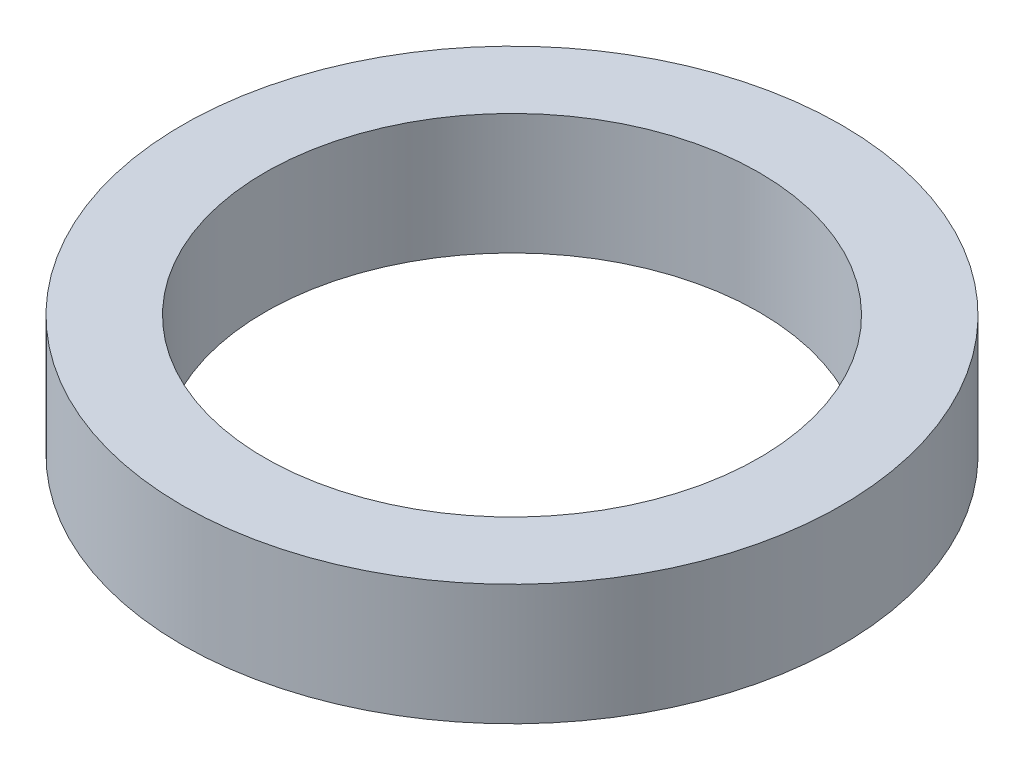
ISO-10303-21;
HEADER;
FILE_DESCRIPTION(('STEP AP214'),'2;1');
FILE_NAME('part.step','',(''),(''),'','','');
FILE_SCHEMA(('AUTOMOTIVE_DESIGN { 1 0 10303 214 1 1 1 1 }'));
ENDSEC;
DATA;
#1=APPLICATION_CONTEXT('core data for automotive mechanical design processes');
#2=APPLICATION_PROTOCOL_DEFINITION('international standard','automotive_design',2000,#1);
#3=PRODUCT_CONTEXT('',#1,'mechanical');
#4=PRODUCT('Part','Part','',(#3));
#5=PRODUCT_RELATED_PRODUCT_CATEGORY('part','',(#4));
#6=PRODUCT_DEFINITION_FORMATION('','',#4);
#7=PRODUCT_DEFINITION_CONTEXT('part definition',#1,'design');
#8=PRODUCT_DEFINITION('design','',#6,#7);
#9=PRODUCT_DEFINITION_SHAPE('','',#8);
#10=(LENGTH_UNIT() NAMED_UNIT(*) SI_UNIT(.MILLI.,.METRE.));
#11=(NAMED_UNIT(*) PLANE_ANGLE_UNIT() SI_UNIT($,.RADIAN.));
#12=(NAMED_UNIT(*) SI_UNIT($,.STERADIAN.) SOLID_ANGLE_UNIT());
#13=UNCERTAINTY_MEASURE_WITH_UNIT(LENGTH_MEASURE(1.E-05),#10,'distance_accuracy_value','');
#14=(GEOMETRIC_REPRESENTATION_CONTEXT(3) GLOBAL_UNCERTAINTY_ASSIGNED_CONTEXT((#13)) GLOBAL_UNIT_ASSIGNED_CONTEXT((#10,
#11,#12)) REPRESENTATION_CONTEXT('',''));
#15=CARTESIAN_POINT('',(0.,0.,0.));
#16=DIRECTION('',(0.,0.,1.));
#17=DIRECTION('',(1.,0.,0.));
#18=AXIS2_PLACEMENT_3D('',#15,#16,#17);
#19=CARTESIAN_POINT('',(0.,0.,0.));
#20=DIRECTION('',(0.,1.,0.));
#21=DIRECTION('',(0.,0.,1.));
#22=AXIS2_PLACEMENT_3D('',#19,#20,#21);
#23=PLANE('',#22);
#24=CARTESIAN_POINT('',(0.,0.,0.));
#25=DIRECTION('',(0.,-1.,0.));
#26=DIRECTION('',(0.,0.,-1.));
#27=AXIS2_PLACEMENT_3D('',#24,#25,#26);
#28=CIRCLE('',#27,45.);
#29=CARTESIAN_POINT('',(0.,0.,-45.));
#30=VERTEX_POINT('',#29);
#31=EDGE_CURVE('E26',#30,#30,#28,.F.);
#32=ORIENTED_EDGE('',*,*,#31,.T.);
#33=EDGE_LOOP('',(#32));
#34=FACE_BOUND('',#33,.T.);
#35=CARTESIAN_POINT('',(0.,0.,0.));
#36=DIRECTION('',(0.,-1.,0.));
#37=DIRECTION('',(0.,0.,-1.));
#38=AXIS2_PLACEMENT_3D('',#35,#36,#37);
#39=CIRCLE('',#38,60.);
#40=CARTESIAN_POINT('',(0.,0.,-60.));
#41=VERTEX_POINT('',#40);
#42=EDGE_CURVE('E17',#41,#41,#39,.F.);
#43=ORIENTED_EDGE('',*,*,#42,.F.);
#44=EDGE_LOOP('',(#43));
#45=FACE_BOUND('',#44,.T.);
#46=ADVANCED_FACE('F14',(#34,#45),#23,.F.);
#47=CARTESIAN_POINT('',(0.,22.,0.));
#48=DIRECTION('',(0.,-1.,0.));
#49=DIRECTION('',(0.,0.,-1.));
#50=AXIS2_PLACEMENT_3D('',#47,#48,#49);
#51=CYLINDRICAL_SURFACE('',#50,60.);
#52=ORIENTED_EDGE('',*,*,#42,.T.);
#53=EDGE_LOOP('',(#52));
#54=FACE_BOUND('',#53,.T.);
#55=CARTESIAN_POINT('',(0.,22.,0.));
#56=DIRECTION('',(0.,-1.,0.));
#57=DIRECTION('',(0.,0.,-1.));
#58=AXIS2_PLACEMENT_3D('',#55,#56,#57);
#59=CIRCLE('',#58,60.);
#60=CARTESIAN_POINT('',(0.,22.,-60.));
#61=VERTEX_POINT('',#60);
#62=EDGE_CURVE('E21',#61,#61,#59,.F.);
#63=ORIENTED_EDGE('',*,*,#62,.F.);
#64=EDGE_LOOP('',(#63));
#65=FACE_BOUND('',#64,.T.);
#66=ADVANCED_FACE('F34',(#54,#65),#51,.T.);
#67=CARTESIAN_POINT('',(0.,22.,0.));
#68=DIRECTION('',(0.,-1.,0.));
#69=DIRECTION('',(0.,0.,-1.));
#70=AXIS2_PLACEMENT_3D('',#67,#68,#69);
#71=CYLINDRICAL_SURFACE('',#70,45.);
#72=CARTESIAN_POINT('',(0.,22.,0.));
#73=DIRECTION('',(0.,-1.,0.));
#74=DIRECTION('',(0.,0.,-1.));
#75=AXIS2_PLACEMENT_3D('',#72,#73,#74);
#76=CIRCLE('',#75,45.);
#77=CARTESIAN_POINT('',(0.,22.,-45.));
#78=VERTEX_POINT('',#77);
#79=EDGE_CURVE('E10',#78,#78,#76,.T.);
#80=ORIENTED_EDGE('',*,*,#79,.F.);
#81=EDGE_LOOP('',(#80));
#82=FACE_BOUND('',#81,.T.);
#83=ORIENTED_EDGE('',*,*,#31,.F.);
#84=EDGE_LOOP('',(#83));
#85=FACE_BOUND('',#84,.T.);
#86=ADVANCED_FACE('F42',(#82,#85),#71,.F.);
#87=CARTESIAN_POINT('',(0.,22.,0.));
#88=DIRECTION('',(0.,1.,0.));
#89=DIRECTION('',(0.,0.,1.));
#90=AXIS2_PLACEMENT_3D('',#87,#88,#89);
#91=PLANE('',#90);
#92=ORIENTED_EDGE('',*,*,#79,.T.);
#93=EDGE_LOOP('',(#92));
#94=FACE_BOUND('',#93,.T.);
#95=ORIENTED_EDGE('',*,*,#62,.T.);
#96=EDGE_LOOP('',(#95));
#97=FACE_BOUND('',#96,.T.);
#98=ADVANCED_FACE('F43',(#94,#97),#91,.T.);
#99=CLOSED_SHELL('',(#46,#66,#86,#98));
#100=MANIFOLD_SOLID_BREP('B1',#99);
#101=ADVANCED_BREP_SHAPE_REPRESENTATION('',(#18,#100),#14);
#102=SHAPE_DEFINITION_REPRESENTATION(#9,#101);
ENDSEC;
END-ISO-10303-21;
